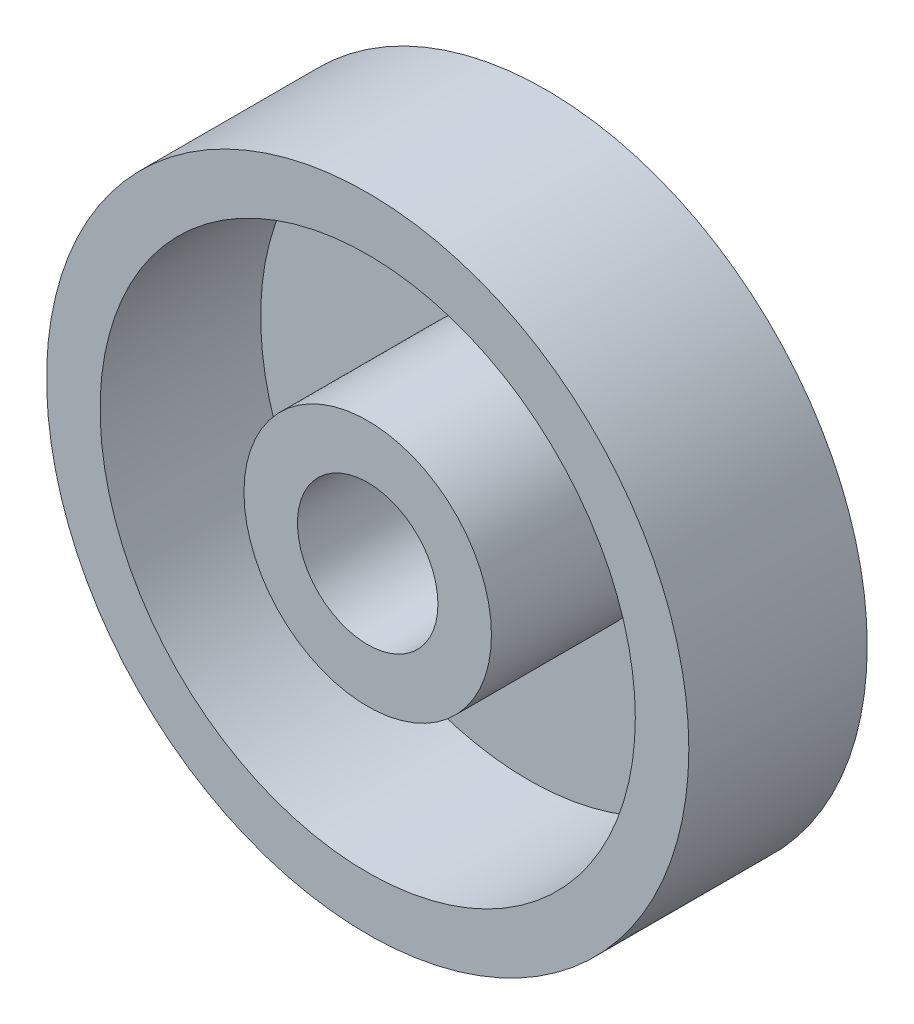
ISO-10303-21;
HEADER;
FILE_DESCRIPTION(('STEP AP214'),'2;1');
FILE_NAME('part.step','',(''),(''),'','','');
FILE_SCHEMA(('AUTOMOTIVE_DESIGN { 1 0 10303 214 1 1 1 1 }'));
ENDSEC;
DATA;
#1=APPLICATION_CONTEXT('core data for automotive mechanical design processes');
#2=APPLICATION_PROTOCOL_DEFINITION('international standard','automotive_design',2000,#1);
#3=PRODUCT_CONTEXT('',#1,'mechanical');
#4=PRODUCT('Part','Part','',(#3));
#5=PRODUCT_RELATED_PRODUCT_CATEGORY('part','',(#4));
#6=PRODUCT_DEFINITION_FORMATION('','',#4);
#7=PRODUCT_DEFINITION_CONTEXT('part definition',#1,'design');
#8=PRODUCT_DEFINITION('design','',#6,#7);
#9=PRODUCT_DEFINITION_SHAPE('','',#8);
#10=(LENGTH_UNIT() NAMED_UNIT(*) SI_UNIT(.MILLI.,.METRE.));
#11=(NAMED_UNIT(*) PLANE_ANGLE_UNIT() SI_UNIT($,.RADIAN.));
#12=(NAMED_UNIT(*) SI_UNIT($,.STERADIAN.) SOLID_ANGLE_UNIT());
#13=UNCERTAINTY_MEASURE_WITH_UNIT(LENGTH_MEASURE(1.E-05),#10,'distance_accuracy_value','');
#14=(GEOMETRIC_REPRESENTATION_CONTEXT(3) GLOBAL_UNCERTAINTY_ASSIGNED_CONTEXT((#13)) GLOBAL_UNIT_ASSIGNED_CONTEXT((#10,
#11,#12)) REPRESENTATION_CONTEXT('',''));
#15=CARTESIAN_POINT('',(0.,0.,0.));
#16=DIRECTION('',(0.,0.,1.));
#17=DIRECTION('',(1.,0.,0.));
#18=AXIS2_PLACEMENT_3D('',#15,#16,#17);
#19=CARTESIAN_POINT('',(0.,0.,127.));
#20=DIRECTION('',(0.,0.,1.));
#21=DIRECTION('',(1.,0.,0.));
#22=AXIS2_PLACEMENT_3D('',#19,#20,#21);
#23=PLANE('',#22);
#24=CARTESIAN_POINT('',(0.,0.,127.));
#25=DIRECTION('',(0.,0.,1.));
#26=DIRECTION('',(1.,0.,0.));
#27=AXIS2_PLACEMENT_3D('',#24,#25,#26);
#28=CIRCLE('',#27,50.);
#29=CARTESIAN_POINT('',(50.,0.,127.));
#30=VERTEX_POINT('',#29);
#31=EDGE_CURVE('E51',#30,#30,#28,.T.);
#32=ORIENTED_EDGE('',*,*,#31,.F.);
#33=EDGE_LOOP('',(#32));
#34=FACE_BOUND('',#33,.T.);
#35=CARTESIAN_POINT('',(0.,0.,127.));
#36=DIRECTION('',(0.,0.,1.));
#37=DIRECTION('',(1.,0.,0.));
#38=AXIS2_PLACEMENT_3D('',#35,#36,#37);
#39=CIRCLE('',#38,88.1);
#40=CARTESIAN_POINT('',(88.1,0.,127.));
#41=VERTEX_POINT('',#40);
#42=EDGE_CURVE('E68',#41,#41,#39,.T.);
#43=ORIENTED_EDGE('',*,*,#42,.T.);
#44=EDGE_LOOP('',(#43));
#45=FACE_BOUND('',#44,.T.);
#46=ADVANCED_FACE('F37',(#34,#45),#23,.T.);
#47=CARTESIAN_POINT('',(0.,0.,127.));
#48=DIRECTION('',(0.,0.,1.));
#49=DIRECTION('',(1.,0.,0.));
#50=AXIS2_PLACEMENT_3D('',#47,#48,#49);
#51=CIRCLE('',#50,190.5);
#52=CARTESIAN_POINT('',(190.5,0.,127.));
#53=VERTEX_POINT('',#52);
#54=EDGE_CURVE('E60',#53,#53,#51,.T.);
#55=ORIENTED_EDGE('',*,*,#54,.F.);
#56=EDGE_LOOP('',(#55));
#57=FACE_BOUND('',#56,.T.);
#58=CARTESIAN_POINT('',(0.,0.,127.));
#59=DIRECTION('',(0.,0.,1.));
#60=DIRECTION('',(1.,0.,0.));
#61=AXIS2_PLACEMENT_3D('',#58,#59,#60);
#62=CIRCLE('',#61,228.6);
#63=CARTESIAN_POINT('',(228.6,0.,127.));
#64=VERTEX_POINT('',#63);
#65=EDGE_CURVE('E10',#64,#64,#62,.T.);
#66=ORIENTED_EDGE('',*,*,#65,.T.);
#67=EDGE_LOOP('',(#66));
#68=FACE_BOUND('',#67,.T.);
#69=ADVANCED_FACE('F92',(#57,#68),#23,.T.);
#70=CARTESIAN_POINT('',(0.,0.,0.));
#71=DIRECTION('',(0.,0.,1.));
#72=DIRECTION('',(1.,0.,0.));
#73=AXIS2_PLACEMENT_3D('',#70,#71,#72);
#74=PLANE('',#73);
#75=CARTESIAN_POINT('',(0.,0.,0.));
#76=DIRECTION('',(0.,0.,1.));
#77=DIRECTION('',(1.,0.,0.));
#78=AXIS2_PLACEMENT_3D('',#75,#76,#77);
#79=CIRCLE('',#78,228.6);
#80=CARTESIAN_POINT('',(228.6,0.,0.));
#81=VERTEX_POINT('',#80);
#82=EDGE_CURVE('E41',#81,#81,#79,.T.);
#83=ORIENTED_EDGE('',*,*,#82,.F.);
#84=EDGE_LOOP('',(#83));
#85=FACE_BOUND('',#84,.T.);
#86=CARTESIAN_POINT('',(0.,0.,0.));
#87=DIRECTION('',(0.,0.,1.));
#88=DIRECTION('',(1.,0.,0.));
#89=AXIS2_PLACEMENT_3D('',#86,#87,#88);
#90=CIRCLE('',#89,50.);
#91=CARTESIAN_POINT('',(50.,0.,0.));
#92=VERTEX_POINT('',#91);
#93=EDGE_CURVE('E53',#92,#92,#90,.T.);
#94=ORIENTED_EDGE('',*,*,#93,.T.);
#95=EDGE_LOOP('',(#94));
#96=FACE_BOUND('',#95,.T.);
#97=ADVANCED_FACE('F94',(#85,#96),#74,.F.);
#98=CARTESIAN_POINT('',(0.,0.,127.));
#99=DIRECTION('',(0.,0.,-1.));
#100=DIRECTION('',(-1.,0.,0.));
#101=AXIS2_PLACEMENT_3D('',#98,#99,#100);
#102=CYLINDRICAL_SURFACE('',#101,228.6);
#103=ORIENTED_EDGE('',*,*,#65,.F.);
#104=EDGE_LOOP('',(#103));
#105=FACE_BOUND('',#104,.T.);
#106=ORIENTED_EDGE('',*,*,#82,.T.);
#107=EDGE_LOOP('',(#106));
#108=FACE_BOUND('',#107,.T.);
#109=ADVANCED_FACE('F39',(#105,#108),#102,.T.);
#110=CARTESIAN_POINT('',(0.,0.,127.));
#111=DIRECTION('',(0.,0.,-1.));
#112=DIRECTION('',(-1.,0.,0.));
#113=AXIS2_PLACEMENT_3D('',#110,#111,#112);
#114=CYLINDRICAL_SURFACE('',#113,50.);
#115=ORIENTED_EDGE('',*,*,#31,.T.);
#116=EDGE_LOOP('',(#115));
#117=FACE_BOUND('',#116,.T.);
#118=ORIENTED_EDGE('',*,*,#93,.F.);
#119=EDGE_LOOP('',(#118));
#120=FACE_BOUND('',#119,.T.);
#121=ADVANCED_FACE('F88',(#117,#120),#114,.F.);
#122=CARTESIAN_POINT('',(0.,0.,12.7));
#123=DIRECTION('',(0.,0.,1.));
#124=DIRECTION('',(1.,0.,0.));
#125=AXIS2_PLACEMENT_3D('',#122,#123,#124);
#126=CYLINDRICAL_SURFACE('',#125,190.5);
#127=CARTESIAN_POINT('',(0.,0.,12.7));
#128=DIRECTION('',(0.,0.,1.));
#129=DIRECTION('',(1.,0.,0.));
#130=AXIS2_PLACEMENT_3D('',#127,#128,#129);
#131=CIRCLE('',#130,190.5);
#132=CARTESIAN_POINT('',(190.5,0.,12.7));
#133=VERTEX_POINT('',#132);
#134=EDGE_CURVE('E57',#133,#133,#131,.T.);
#135=ORIENTED_EDGE('',*,*,#134,.F.);
#136=EDGE_LOOP('',(#135));
#137=FACE_BOUND('',#136,.T.);
#138=ORIENTED_EDGE('',*,*,#54,.T.);
#139=EDGE_LOOP('',(#138));
#140=FACE_BOUND('',#139,.T.);
#141=ADVANCED_FACE('F82',(#137,#140),#126,.F.);
#142=CARTESIAN_POINT('',(0.,0.,12.7));
#143=DIRECTION('',(0.,0.,1.));
#144=DIRECTION('',(1.,0.,0.));
#145=AXIS2_PLACEMENT_3D('',#142,#143,#144);
#146=PLANE('',#145);
#147=CARTESIAN_POINT('',(0.,0.,12.7));
#148=DIRECTION('',(0.,0.,1.));
#149=DIRECTION('',(1.,0.,0.));
#150=AXIS2_PLACEMENT_3D('',#147,#148,#149);
#151=CIRCLE('',#150,88.1);
#152=CARTESIAN_POINT('',(88.1,0.,12.7));
#153=VERTEX_POINT('',#152);
#154=EDGE_CURVE('E64',#153,#153,#151,.T.);
#155=ORIENTED_EDGE('',*,*,#154,.F.);
#156=EDGE_LOOP('',(#155));
#157=FACE_BOUND('',#156,.T.);
#158=ORIENTED_EDGE('',*,*,#134,.T.);
#159=EDGE_LOOP('',(#158));
#160=FACE_BOUND('',#159,.T.);
#161=ADVANCED_FACE('F79',(#157,#160),#146,.T.);
#162=CARTESIAN_POINT('',(0.,0.,12.7));
#163=DIRECTION('',(0.,0.,1.));
#164=DIRECTION('',(1.,0.,0.));
#165=AXIS2_PLACEMENT_3D('',#162,#163,#164);
#166=CYLINDRICAL_SURFACE('',#165,88.1);
#167=ORIENTED_EDGE('',*,*,#154,.T.);
#168=EDGE_LOOP('',(#167));
#169=FACE_BOUND('',#168,.T.);
#170=ORIENTED_EDGE('',*,*,#42,.F.);
#171=EDGE_LOOP('',(#170));
#172=FACE_BOUND('',#171,.T.);
#173=ADVANCED_FACE('F76',(#169,#172),#166,.T.);
#174=CLOSED_SHELL('',(#46,#69,#97,#109,#121,#141,#161,#173));
#175=MANIFOLD_SOLID_BREP('B2',#174);
#176=ADVANCED_BREP_SHAPE_REPRESENTATION('',(#18,#175),#14);
#177=SHAPE_DEFINITION_REPRESENTATION(#9,#176);
ENDSEC;
END-ISO-10303-21;
